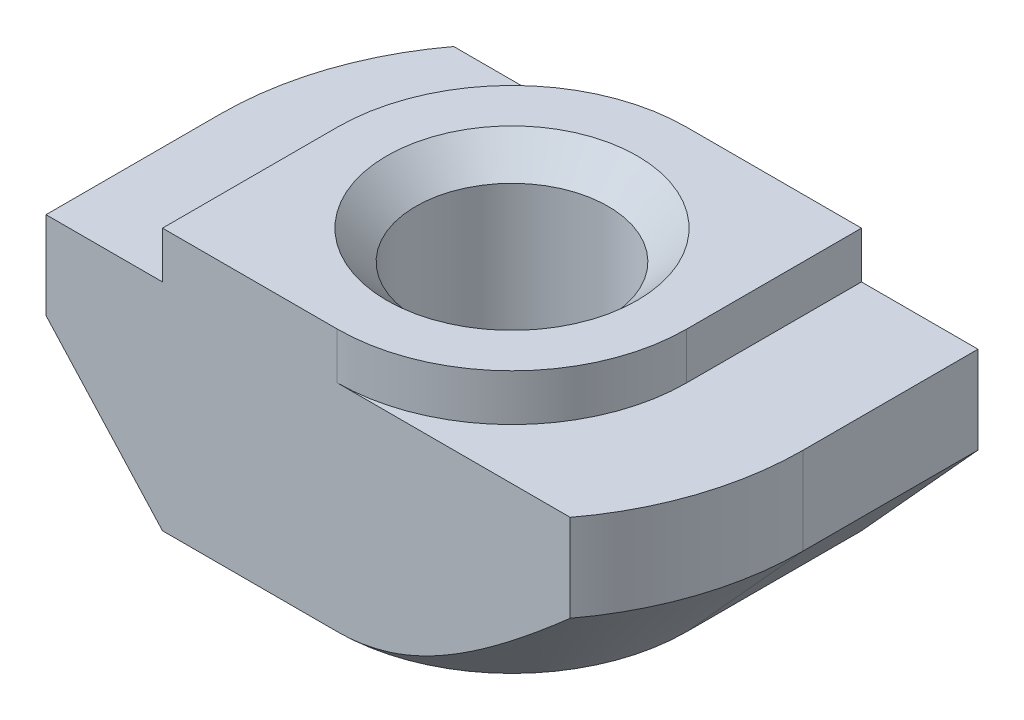
ISO-10303-21;
HEADER;
FILE_DESCRIPTION(('STEP AP214'),'2;1');
FILE_NAME('part.step','',(''),(''),'','','');
FILE_SCHEMA(('AUTOMOTIVE_DESIGN { 1 0 10303 214 1 1 1 1 }'));
ENDSEC;
DATA;
#1=APPLICATION_CONTEXT('core data for automotive mechanical design processes');
#2=APPLICATION_PROTOCOL_DEFINITION('international standard','automotive_design',2000,#1);
#3=PRODUCT_CONTEXT('',#1,'mechanical');
#4=PRODUCT('Part','Part','',(#3));
#5=PRODUCT_RELATED_PRODUCT_CATEGORY('part','',(#4));
#6=PRODUCT_DEFINITION_FORMATION('','',#4);
#7=PRODUCT_DEFINITION_CONTEXT('part definition',#1,'design');
#8=PRODUCT_DEFINITION('design','',#6,#7);
#9=PRODUCT_DEFINITION_SHAPE('','',#8);
#10=(LENGTH_UNIT() NAMED_UNIT(*) SI_UNIT(.MILLI.,.METRE.));
#11=(NAMED_UNIT(*) PLANE_ANGLE_UNIT() SI_UNIT($,.RADIAN.));
#12=(NAMED_UNIT(*) SI_UNIT($,.STERADIAN.) SOLID_ANGLE_UNIT());
#13=UNCERTAINTY_MEASURE_WITH_UNIT(LENGTH_MEASURE(1.E-05),#10,'distance_accuracy_value','');
#14=(GEOMETRIC_REPRESENTATION_CONTEXT(3) GLOBAL_UNCERTAINTY_ASSIGNED_CONTEXT((#13)) GLOBAL_UNIT_ASSIGNED_CONTEXT((#10,
#11,#12)) REPRESENTATION_CONTEXT('',''));
#15=CARTESIAN_POINT('',(0.,0.,0.));
#16=DIRECTION('',(0.,0.,1.));
#17=DIRECTION('',(1.,0.,0.));
#18=AXIS2_PLACEMENT_3D('',#15,#16,#17);
#19=CARTESIAN_POINT('',(-5.,-0.800000000000001,3.));
#20=DIRECTION('',(1.,0.,0.));
#21=DIRECTION('',(0.,0.,-1.));
#22=AXIS2_PLACEMENT_3D('',#19,#20,#21);
#23=PLANE('',#22);
#24=DIRECTION('',(0.,0.,-1.));
#25=VECTOR('',#24,1.);
#26=CARTESIAN_POINT('',(-5.,-2.3,3.));
#27=LINE('',#26,#25);
#28=CARTESIAN_POINT('',(-5.,-2.3,3.));
#29=VERTEX_POINT('',#28);
#30=CARTESIAN_POINT('',(-5.,-2.3,0.));
#31=VERTEX_POINT('',#30);
#32=EDGE_CURVE('E316',#29,#31,#27,.T.);
#33=ORIENTED_EDGE('',*,*,#32,.F.);
#34=DIRECTION('',(0.,-1.,0.));
#35=VECTOR('',#34,1.);
#36=CARTESIAN_POINT('',(-5.,-0.800000000000001,3.));
#37=LINE('',#36,#35);
#38=CARTESIAN_POINT('',(-5.,-0.800000000000001,3.));
#39=VERTEX_POINT('',#38);
#40=EDGE_CURVE('E163',#39,#29,#37,.T.);
#41=ORIENTED_EDGE('',*,*,#40,.F.);
#42=DIRECTION('',(0.,0.,-1.));
#43=VECTOR('',#42,1.);
#44=CARTESIAN_POINT('',(-5.,-0.800000000000001,3.));
#45=LINE('',#44,#43);
#46=CARTESIAN_POINT('',(-5.,-0.800000000000001,0.));
#47=VERTEX_POINT('',#46);
#48=EDGE_CURVE('E45',#39,#47,#45,.T.);
#49=ORIENTED_EDGE('',*,*,#48,.T.);
#50=DIRECTION('',(0.,1.,0.));
#51=VECTOR('',#50,1.);
#52=CARTESIAN_POINT('',(-5.,-4.5,0.));
#53=LINE('',#52,#51);
#54=EDGE_CURVE('E209',#31,#47,#53,.T.);
#55=ORIENTED_EDGE('',*,*,#54,.F.);
#56=EDGE_LOOP('',(#33,#41,#49,#55));
#57=FACE_BOUND('',#56,.T.);
#58=ADVANCED_FACE('F37',(#57),#23,.F.);
#59=CARTESIAN_POINT('',(-5.,-4.5,3.));
#60=DIRECTION('',(0.,1.,0.));
#61=DIRECTION('',(0.,0.,1.));
#62=AXIS2_PLACEMENT_3D('',#59,#60,#61);
#63=PLANE('',#62);
#64=CARTESIAN_POINT('',(0.,-4.5,0.));
#65=DIRECTION('',(0.,1.,0.));
#66=DIRECTION('',(0.,0.,1.));
#67=AXIS2_PLACEMENT_3D('',#64,#65,#66);
#68=CIRCLE('',#67,2.15);
#69=CARTESIAN_POINT('',(0.,-4.5,2.15));
#70=VERTEX_POINT('',#69);
#71=EDGE_CURVE('E258',#70,#70,#68,.T.);
#72=ORIENTED_EDGE('',*,*,#71,.T.);
#73=EDGE_LOOP('',(#72));
#74=FACE_BOUND('',#73,.T.);
#75=DIRECTION('',(1.,0.,0.));
#76=VECTOR('',#75,1.);
#77=CARTESIAN_POINT('',(-5.,-4.5,3.));
#78=LINE('',#77,#76);
#79=CARTESIAN_POINT('',(-3.,-4.5,3.));
#80=VERTEX_POINT('',#79);
#81=CARTESIAN_POINT('',(0.,-4.5,3.));
#82=VERTEX_POINT('',#81);
#83=EDGE_CURVE('E161',#80,#82,#78,.T.);
#84=ORIENTED_EDGE('',*,*,#83,.F.);
#85=DIRECTION('',(0.,0.,-1.));
#86=VECTOR('',#85,1.);
#87=CARTESIAN_POINT('',(-3.,-4.5,3.));
#88=LINE('',#87,#86);
#89=CARTESIAN_POINT('',(-3.,-4.5,0.));
#90=VERTEX_POINT('',#89);
#91=EDGE_CURVE('E146',#80,#90,#88,.T.);
#92=ORIENTED_EDGE('',*,*,#91,.T.);
#93=CARTESIAN_POINT('',(0.,-4.5,0.));
#94=DIRECTION('',(0.,-1.,0.));
#95=DIRECTION('',(-1.,0.,0.));
#96=AXIS2_PLACEMENT_3D('',#93,#94,#95);
#97=CIRCLE('',#96,2.99999999999998);
#98=CARTESIAN_POINT('',(0.,-4.5,-2.99999999999998));
#99=VERTEX_POINT('',#98);
#100=EDGE_CURVE('E317',#90,#99,#97,.T.);
#101=ORIENTED_EDGE('',*,*,#100,.T.);
#102=DIRECTION('',(1.,0.,0.));
#103=VECTOR('',#102,1.);
#104=CARTESIAN_POINT('',(-5.,-4.5,-3.));
#105=LINE('',#104,#103);
#106=CARTESIAN_POINT('',(3.,-4.5,-3.));
#107=VERTEX_POINT('',#106);
#108=EDGE_CURVE('E181',#99,#107,#105,.T.);
#109=ORIENTED_EDGE('',*,*,#108,.T.);
#110=DIRECTION('',(0.,0.,1.));
#111=VECTOR('',#110,1.);
#112=CARTESIAN_POINT('',(3.,-4.5,-5.));
#113=LINE('',#112,#111);
#114=CARTESIAN_POINT('',(3.,-4.5,0.));
#115=VERTEX_POINT('',#114);
#116=EDGE_CURVE('E52',#107,#115,#113,.T.);
#117=ORIENTED_EDGE('',*,*,#116,.T.);
#118=CARTESIAN_POINT('',(0.,-4.5,0.));
#119=DIRECTION('',(0.,-1.,0.));
#120=DIRECTION('',(1.,0.,0.));
#121=AXIS2_PLACEMENT_3D('',#118,#119,#120);
#122=CIRCLE('',#121,3.);
#123=EDGE_CURVE('E167',#115,#82,#122,.T.);
#124=ORIENTED_EDGE('',*,*,#123,.T.);
#125=EDGE_LOOP('',(#84,#92,#101,#109,#117,#124));
#126=FACE_BOUND('',#125,.T.);
#127=ADVANCED_FACE('F166',(#74,#126),#63,.F.);
#128=CARTESIAN_POINT('',(5.,-0.800000000000001,3.));
#129=DIRECTION('',(-1.,0.,0.));
#130=DIRECTION('',(0.,0.,1.));
#131=AXIS2_PLACEMENT_3D('',#128,#129,#130);
#132=PLANE('',#131);
#133=DIRECTION('',(0.,0.,1.));
#134=VECTOR('',#133,1.);
#135=CARTESIAN_POINT('',(5.,-2.3,-5.));
#136=LINE('',#135,#134);
#137=CARTESIAN_POINT('',(5.,-2.3,-3.));
#138=VERTEX_POINT('',#137);
#139=CARTESIAN_POINT('',(5.,-2.3,0.));
#140=VERTEX_POINT('',#139);
#141=EDGE_CURVE('E304',#138,#140,#136,.T.);
#142=ORIENTED_EDGE('',*,*,#141,.F.);
#143=DIRECTION('',(0.,1.,0.));
#144=VECTOR('',#143,1.);
#145=CARTESIAN_POINT('',(5.,-0.800000000000001,-3.));
#146=LINE('',#145,#144);
#147=CARTESIAN_POINT('',(5.,-0.800000000000001,-3.));
#148=VERTEX_POINT('',#147);
#149=EDGE_CURVE('E185',#138,#148,#146,.T.);
#150=ORIENTED_EDGE('',*,*,#149,.T.);
#151=DIRECTION('',(0.,0.,-1.));
#152=VECTOR('',#151,1.);
#153=CARTESIAN_POINT('',(5.,-0.800000000000001,3.));
#154=LINE('',#153,#152);
#155=CARTESIAN_POINT('',(5.,-0.799999999999999,0.));
#156=VERTEX_POINT('',#155);
#157=EDGE_CURVE('E203',#156,#148,#154,.T.);
#158=ORIENTED_EDGE('',*,*,#157,.F.);
#159=DIRECTION('',(0.,1.,0.));
#160=VECTOR('',#159,1.);
#161=CARTESIAN_POINT('',(5.,-4.5,0.));
#162=LINE('',#161,#160);
#163=EDGE_CURVE('E220',#140,#156,#162,.T.);
#164=ORIENTED_EDGE('',*,*,#163,.F.);
#165=EDGE_LOOP('',(#142,#150,#158,#164));
#166=FACE_BOUND('',#165,.T.);
#167=ADVANCED_FACE('F303',(#166),#132,.F.);
#168=CARTESIAN_POINT('',(0.,0.,3.));
#169=DIRECTION('',(0.,0.,-1.));
#170=DIRECTION('',(-1.,0.,0.));
#171=AXIS2_PLACEMENT_3D('',#168,#169,#170);
#172=PLANE('',#171);
#173=DIRECTION('',(-0.672672793996312,0.739940073395944,0.));
#174=VECTOR('',#173,1.);
#175=CARTESIAN_POINT('',(-3.,-4.5,3.));
#176=LINE('',#175,#174);
#177=EDGE_CURVE('E149',#80,#29,#176,.T.);
#178=ORIENTED_EDGE('',*,*,#177,.F.);
#179=ORIENTED_EDGE('',*,*,#83,.T.);
#180=CARTESIAN_POINT('',(8.56528488420533,2.18301393510955,3.));
#181=CARTESIAN_POINT('',(8.336042392276,1.94506172446586,3.));
#182=CARTESIAN_POINT('',(8.10631311159504,1.70757430920956,3.));
#183=CARTESIAN_POINT('',(7.64551409680837,1.23387312686237,3.));
#184=CARTESIAN_POINT('',(7.41444427373792,0.997659446357017,3.));
#185=CARTESIAN_POINT('',(6.95074727857469,0.527002922284947,3.));
#186=CARTESIAN_POINT('',(6.71812096870712,0.292559230318829,3.));
#187=CARTESIAN_POINT('',(6.25067088889651,-0.174118776187672,3.));
#188=CARTESIAN_POINT('',(6.01584718443249,-0.406353156148946,3.));
#189=CARTESIAN_POINT('',(5.62038955383489,-0.792436278152886,3.));
#190=CARTESIAN_POINT('',(5.4605691961006,-0.947117710041531,3.));
#191=CARTESIAN_POINT('',(5.13924211280618,-1.25471973911822,3.));
#192=CARTESIAN_POINT('',(4.97773540088465,-1.40764035052612,3.));
#193=CARTESIAN_POINT('',(4.65243717389983,-1.71134723849659,3.));
#194=CARTESIAN_POINT('',(4.48864364367823,-1.86213136124613,3.));
#195=CARTESIAN_POINT('',(4.15832129849217,-2.16066244382769,3.));
#196=CARTESIAN_POINT('',(3.99179267344124,-2.30840961294253,3.));
#197=CARTESIAN_POINT('',(3.67502933959276,-2.58253769216048,3.));
#198=CARTESIAN_POINT('',(3.52519519671427,-2.70937994437701,3.));
#199=CARTESIAN_POINT('',(3.22192221001868,-2.95867422998659,3.));
#200=CARTESIAN_POINT('',(3.06848376607595,-3.08112674662078,3.));
#201=CARTESIAN_POINT('',(2.75692799570068,-3.31985912877086,3.));
#202=CARTESIAN_POINT('',(2.59881223241667,-3.43614102099504,3.));
#203=CARTESIAN_POINT('',(2.27641686005113,-3.6597947081815,3.));
#204=CARTESIAN_POINT('',(2.1121408480234,-3.76717158878603,3.));
#205=CARTESIAN_POINT('',(1.85623649412789,-3.92021652847901,3.));
#206=CARTESIAN_POINT('',(1.7675565261946,-3.9707797472168,3.));
#207=CARTESIAN_POINT('',(1.58775783924168,-4.06731951755835,3.));
#208=CARTESIAN_POINT('',(1.49663894517337,-4.11329573881462,3.));
#209=CARTESIAN_POINT('',(1.21939259558399,-4.24256333018006,3.));
#210=CARTESIAN_POINT('',(1.02899510158821,-4.31743209180478,3.));
#211=CARTESIAN_POINT('',(0.755392260011176,-4.39800283607005,3.));
#212=CARTESIAN_POINT('',(0.676405488815064,-4.41825370574629,3.));
#213=CARTESIAN_POINT('',(0.517091283393969,-4.45243980770036,3.));
#214=CARTESIAN_POINT('',(0.436764560189595,-4.46637828552201,3.));
#215=CARTESIAN_POINT('',(0.275359895285572,-4.48729817004741,3.));
#216=CARTESIAN_POINT('',(0.194283722501903,-4.49429308094364,3.));
#217=CARTESIAN_POINT('',(0.0318264670063591,-4.50102204849326,3.));
#218=CARTESIAN_POINT('',(-0.0495546116377827,-4.5007562016696,3.));
#219=CARTESIAN_POINT('',(-0.211948053666092,-4.49297827159353,3.));
#220=CARTESIAN_POINT('',(-0.292960487989283,-4.48546764732863,3.));
#221=CARTESIAN_POINT('',(-0.454044201528726,-4.46357758160782,3.));
#222=CARTESIAN_POINT('',(-0.534115415562824,-4.44919766727235,3.));
#223=CARTESIAN_POINT('',(-0.693058117709121,-4.41417073117944,3.));
#224=CARTESIAN_POINT('',(-0.771926319049785,-4.39350896200337,3.));
#225=CARTESIAN_POINT('',(-0.927999706858947,-4.34671001550421,3.));
#226=CARTESIAN_POINT('',(-1.0052048597811,-4.320572727845,3.));
#227=CARTESIAN_POINT('',(-1.25592725377758,-4.22704979034008,3.));
#228=CARTESIAN_POINT('',(-1.42577516041485,-4.14980515635623,3.));
#229=CARTESIAN_POINT('',(-1.7571229896981,-3.97902915008715,3.));
#230=CARTESIAN_POINT('',(-1.91860569192747,-3.88546578765243,3.));
#231=CARTESIAN_POINT('',(-2.23613244034585,-3.68665550264099,3.));
#232=CARTESIAN_POINT('',(-2.39211515222633,-3.58131183983245,3.));
#233=CARTESIAN_POINT('',(-2.69855763508462,-3.36322232970804,3.));
#234=CARTESIAN_POINT('',(-2.84902171438153,-3.25048245691053,3.));
#235=CARTESIAN_POINT('',(-3.13482661197324,-3.02826682192062,3.));
#236=CARTESIAN_POINT('',(-3.27046224875265,-2.91916755772444,3.));
#237=CARTESIAN_POINT('',(-3.53896291037127,-2.6975660478194,3.));
#238=CARTESIAN_POINT('',(-3.67182732431156,-2.58506306490047,3.));
#239=CARTESIAN_POINT('',(-3.93243210144877,-2.35998699053387,3.));
#240=CARTESIAN_POINT('',(-4.06022090599257,-2.24746976299248,3.));
#241=CARTESIAN_POINT('',(-4.31399463935954,-2.02052874188546,3.));
#242=CARTESIAN_POINT('',(-4.43998034134838,-1.90610581397421,3.));
#243=CARTESIAN_POINT('',(-4.56528488420533,-1.79095602034035,3.));
#244=B_SPLINE_CURVE_WITH_KNOTS('',3,(#180,#181,#182,#183,#184,#185,#186,#187,#188,#189,#190,
#191,#192,#193,#194,#195,#196,#197,#198,#199,#200,#201,#202,#203,#204,#205,#206,#207,#208,#209,
#210,#211,#212,#213,#214,#215,#216,#217,#218,#219,#220,#221,#222,#223,#224,#225,#226,#227,#228,
#229,#230,#231,#232,#233,#234,#235,#236,#237,#238,#239,#240,#241,#242,#243),.UNSPECIFIED.,.F.,
.F.,(4,2,2,2,2,2,2,2,2,2,2,2,2,2,2,2,2,2,2,2,2,2,2,2,2,2,2,2,2,2,2,4),(0.,0.991245743739621,
1.98255804143403,2.9733604179706,3.96413336353297,4.63137143495993,5.29860411419179,
5.96646741219647,6.63428453099802,7.22316869295618,7.81198782766621,8.40061235546637,
8.98889837171226,9.29501429973074,9.60115225778937,10.2120870943495,10.4565075459561,
10.7008021846476,10.9446207706796,11.1884361154411,11.4322023697656,11.6759854072942,
11.9203452331532,12.164709983534,12.7229572376404,13.2823114015797,13.8466531824608,
14.410544581934,14.9326795174098,15.4549283631006,15.9657012579663,16.4762481441375),.UNSPECIFIED.);
#245=CARTESIAN_POINT('',(4.,-2.3,3.));
#246=VERTEX_POINT('',#245);
#247=EDGE_CURVE('E321',#246,#82,#244,.T.);
#248=ORIENTED_EDGE('',*,*,#247,.F.);
#249=DIRECTION('',(0.,1.,0.));
#250=VECTOR('',#249,1.);
#251=CARTESIAN_POINT('',(4.,-4.5,3.));
#252=LINE('',#251,#250);
#253=CARTESIAN_POINT('',(4.,-0.8,3.));
#254=VERTEX_POINT('',#253);
#255=EDGE_CURVE('E223',#246,#254,#252,.T.);
#256=ORIENTED_EDGE('',*,*,#255,.T.);
#257=DIRECTION('',(-1.,0.,0.));
#258=VECTOR('',#257,1.);
#259=CARTESIAN_POINT('',(3.,-0.8,3.));
#260=LINE('',#259,#258);
#261=CARTESIAN_POINT('',(0.,-0.8,3.));
#262=VERTEX_POINT('',#261);
#263=EDGE_CURVE('E168',#254,#262,#260,.T.);
#264=ORIENTED_EDGE('',*,*,#263,.T.);
#265=DIRECTION('',(0.,1.,0.));
#266=VECTOR('',#265,1.);
#267=CARTESIAN_POINT('',(0.,-5.04264068711929,3.));
#268=LINE('',#267,#266);
#269=CARTESIAN_POINT('',(0.,0.,3.));
#270=VERTEX_POINT('',#269);
#271=EDGE_CURVE('E246',#262,#270,#268,.T.);
#272=ORIENTED_EDGE('',*,*,#271,.T.);
#273=DIRECTION('',(-1.,0.,0.));
#274=VECTOR('',#273,1.);
#275=CARTESIAN_POINT('',(3.,0.,3.));
#276=LINE('',#275,#274);
#277=CARTESIAN_POINT('',(-3.,0.,3.));
#278=VERTEX_POINT('',#277);
#279=EDGE_CURVE('E170',#270,#278,#276,.T.);
#280=ORIENTED_EDGE('',*,*,#279,.T.);
#281=DIRECTION('',(0.,-1.,0.));
#282=VECTOR('',#281,1.);
#283=CARTESIAN_POINT('',(-3.,0.,3.));
#284=LINE('',#283,#282);
#285=CARTESIAN_POINT('',(-3.,-0.8,3.));
#286=VERTEX_POINT('',#285);
#287=EDGE_CURVE('E196',#278,#286,#284,.T.);
#288=ORIENTED_EDGE('',*,*,#287,.T.);
#289=DIRECTION('',(-1.,0.,0.));
#290=VECTOR('',#289,1.);
#291=CARTESIAN_POINT('',(-3.,-0.8,3.));
#292=LINE('',#291,#290);
#293=EDGE_CURVE('E172',#286,#39,#292,.T.);
#294=ORIENTED_EDGE('',*,*,#293,.T.);
#295=ORIENTED_EDGE('',*,*,#40,.T.);
#296=EDGE_LOOP('',(#178,#179,#248,#256,#264,#272,#280,#288,#294,#295));
#297=FACE_BOUND('',#296,.T.);
#298=ADVANCED_FACE('F159',(#297),#172,.F.);
#299=CARTESIAN_POINT('',(0.,0.,-3.));
#300=DIRECTION('',(0.,0.,-1.));
#301=DIRECTION('',(-1.,0.,0.));
#302=AXIS2_PLACEMENT_3D('',#299,#300,#301);
#303=PLANE('',#302);
#304=ORIENTED_EDGE('',*,*,#108,.F.);
#305=CARTESIAN_POINT('',(4.56528488420533,-1.79095602034032,-3.));
#306=CARTESIAN_POINT('',(4.42839885729641,-1.91673342260761,-3.));
#307=CARTESIAN_POINT('',(4.29070825629604,-2.04165708123198,-3.));
#308=CARTESIAN_POINT('',(4.01311022137334,-2.2891985262993,-3.));
#309=CARTESIAN_POINT('',(3.87320138847394,-2.41181474149276,-3.));
#310=CARTESIAN_POINT('',(3.5856246865415,-2.65835932361061,-3.));
#311=CARTESIAN_POINT('',(3.43785929429621,-2.78217447169403,-3.));
#312=CARTESIAN_POINT('',(3.13870555712778,-3.02527946804254,-3.));
#313=CARTESIAN_POINT('',(2.98731837973417,-3.14457074341603,-3.));
#314=CARTESIAN_POINT('',(2.67932755554925,-3.37720476464405,-3.));
#315=CARTESIAN_POINT('',(2.52271020820245,-3.49052949185593,-3.));
#316=CARTESIAN_POINT('',(2.20296452147528,-3.7081776430567,-3.));
#317=CARTESIAN_POINT('',(2.03982933047826,-3.81249120982559,-3.));
#318=CARTESIAN_POINT('',(1.79019758577874,-3.9578704108561,-3.));
#319=CARTESIAN_POINT('',(1.7067775126684,-4.00418975204737,-3.));
#320=CARTESIAN_POINT('',(1.53775147544231,-4.09263547313203,-3.));
#321=CARTESIAN_POINT('',(1.45214519070862,-4.13476123352878,-3.));
#322=CARTESIAN_POINT('',(1.19210931334085,-4.25323556698663,-3.));
#323=CARTESIAN_POINT('',(1.01395131317746,-4.32199210170041,-3.));
#324=CARTESIAN_POINT('',(0.745346751873809,-4.40089868793778,-3.));
#325=CARTESIAN_POINT('',(0.658318453040623,-4.42281603815454,-3.));
#326=CARTESIAN_POINT('',(0.482642298238637,-4.45891278284897,-3.));
#327=CARTESIAN_POINT('',(0.393994581761194,-4.47309284057409,-3.));
#328=CARTESIAN_POINT('',(0.216037909471066,-4.49288207496988,-3.));
#329=CARTESIAN_POINT('',(0.126732197427173,-4.49852003254059,-3.));
#330=CARTESIAN_POINT('',(-0.0520026715756645,-4.50096807462647,-3.));
#331=CARTESIAN_POINT('',(-0.141431827603297,-4.49777822538231,-3.));
#332=CARTESIAN_POINT('',(-0.319250763933687,-4.48279609283911,-3.));
#333=CARTESIAN_POINT('',(-0.407643026018313,-4.47103273201148,-3.));
#334=CARTESIAN_POINT('',(-0.583018344588809,-4.43960959822698,-3.));
#335=CARTESIAN_POINT('',(-0.670000952598425,-4.41994736165903,-3.));
#336=CARTESIAN_POINT('',(-0.842486782458988,-4.37358373680897,-3.));
#337=CARTESIAN_POINT('',(-0.9279810314998,-4.34684940618518,-3.));
#338=CARTESIAN_POINT('',(-1.0968573659184,-4.28745146556704,-3.));
#339=CARTESIAN_POINT('',(-1.18023946905554,-4.25478790544571,-3.));
#340=CARTESIAN_POINT('',(-1.36570253725023,-4.17565465593902,-3.));
#341=CARTESIAN_POINT('',(-1.46718157138529,-4.12778226156665,-3.));
#342=CARTESIAN_POINT('',(-1.66707298699795,-4.02597724576113,-3.));
#343=CARTESIAN_POINT('',(-1.76548385637139,-3.97204169465492,-3.));
#344=CARTESIAN_POINT('',(-1.95973278437517,-3.85933814531602,-3.));
#345=CARTESIAN_POINT('',(-2.05556549824463,-3.80056100153299,-3.));
#346=CARTESIAN_POINT('',(-2.24481227463867,-3.6792892907557,-3.));
#347=CARTESIAN_POINT('',(-2.33822672015715,-3.61679531764913,-3.));
#348=CARTESIAN_POINT('',(-2.52405927711159,-3.48811153305375,-3.));
#349=CARTESIAN_POINT('',(-2.61645357258282,-3.42188748133433,-3.));
#350=CARTESIAN_POINT('',(-2.79944858607247,-3.28700935921293,-3.));
#351=CARTESIAN_POINT('',(-2.89004925164131,-3.21835521791309,-3.));
#352=CARTESIAN_POINT('',(-3.06961311011181,-3.07915767893173,-3.));
#353=CARTESIAN_POINT('',(-3.15857809973083,-3.00861659270619,-3.));
#354=CARTESIAN_POINT('',(-3.33519795578114,-2.86591970498384,-3.));
#355=CARTESIAN_POINT('',(-3.4228528435281,-2.79376392980623,-3.));
#356=CARTESIAN_POINT('',(-3.62621162727783,-2.62372045812024,-3.));
#357=CARTESIAN_POINT('',(-3.74147696764729,-2.52530870473998,-3.));
#358=CARTESIAN_POINT('',(-3.97036354639596,-2.32658886836678,-3.));
#359=CARTESIAN_POINT('',(-4.08398472073968,-2.2262807118635,-3.));
#360=CARTESIAN_POINT('',(-4.42284189926169,-1.92305836675397,-3.));
#361=CARTESIAN_POINT('',(-4.64604269620312,-1.71787076794243,-3.));
#362=CARTESIAN_POINT('',(-5.08885043587136,-1.30320023106152,-3.));
#363=CARTESIAN_POINT('',(-5.30845317819351,-1.09371283796563,-3.));
#364=CARTESIAN_POINT('',(-5.74484899551352,-0.671825061357189,-3.));
#365=CARTESIAN_POINT('',(-5.96164199489613,-0.459424599763989,-3.));
#366=CARTESIAN_POINT('',(-6.37936652531521,-0.0460880905598762,-3.));
#367=CARTESIAN_POINT('',(-6.58042866504368,0.154716268202102,-3.));
#368=CARTESIAN_POINT('',(-6.98110372806068,0.557774180103405,-3.));
#369=CARTESIAN_POINT('',(-7.18071661572182,0.760027768628347,-3.));
#370=CARTESIAN_POINT('',(-7.5783559544936,1.16522743736274,-3.));
#371=CARTESIAN_POINT('',(-7.77638490659006,1.36817106601214,-3.));
#372=CARTESIAN_POINT('',(-8.17149294521518,1.77496414757543,-3.));
#373=CARTESIAN_POINT('',(-8.36857207240979,1.97881356097766,-3.));
#374=CARTESIAN_POINT('',(-8.56528488420533,2.18301393510958,-3.));
#375=B_SPLINE_CURVE_WITH_KNOTS('',3,(#305,#306,#307,#308,#309,#310,#311,#312,#313,#314,#315,
#316,#317,#318,#319,#320,#321,#322,#323,#324,#325,#326,#327,#328,#329,#330,#331,#332,#333,#334,
#335,#336,#337,#338,#339,#340,#341,#342,#343,#344,#345,#346,#347,#348,#349,#350,#351,#352,#353,
#354,#355,#356,#357,#358,#359,#360,#361,#362,#363,#364,#365,#366,#367,#368,#369,#370,#371,#372,
#373,#374),.UNSPECIFIED.,.F.,.F.,(4,2,2,2,2,2,2,2,2,2,2,2,2,2,2,2,2,2,2,2,2,2,2,2,2,2,2,2,2,2,2,
2,2,2,4),(0.,0.557709889033308,1.11578672818032,1.69406871798971,2.27216673821034,
2.85192074217125,3.43230110810091,3.71843822555145,4.00461755007192,4.57518829810499,
4.84414410060724,5.11307684436059,5.38110144203277,5.64912402855096,5.91624660987452,
6.18345256986256,6.45192580847491,6.72039678896069,7.05673990097462,7.39324623580336,
7.73040347109618,8.0675069782348,8.40848761114185,8.74947820037108,9.0900686587882,
9.43065356966887,9.88531114864963,10.3399863878215,11.2494503335336,12.1599095877827,
13.0703932934704,13.922872369386,14.775372331565,15.6260242906098,16.4766395002808),.UNSPECIFIED.);
#376=CARTESIAN_POINT('',(-4.,-2.29999999999998,-3.));
#377=VERTEX_POINT('',#376);
#378=EDGE_CURVE('E227',#99,#377,#375,.T.);
#379=ORIENTED_EDGE('',*,*,#378,.T.);
#380=DIRECTION('',(0.,1.,0.));
#381=VECTOR('',#380,1.);
#382=CARTESIAN_POINT('',(-4.,-4.5,-3.));
#383=LINE('',#382,#381);
#384=CARTESIAN_POINT('',(-4.,-0.8,-3.));
#385=VERTEX_POINT('',#384);
#386=EDGE_CURVE('E219',#377,#385,#383,.T.);
#387=ORIENTED_EDGE('',*,*,#386,.T.);
#388=DIRECTION('',(-1.,0.,0.));
#389=VECTOR('',#388,1.);
#390=CARTESIAN_POINT('',(-3.,-0.8,-3.));
#391=LINE('',#390,#389);
#392=CARTESIAN_POINT('',(0.,-0.8,-3.));
#393=VERTEX_POINT('',#392);
#394=EDGE_CURVE('E178',#393,#385,#391,.T.);
#395=ORIENTED_EDGE('',*,*,#394,.F.);
#396=DIRECTION('',(0.,1.,0.));
#397=VECTOR('',#396,1.);
#398=CARTESIAN_POINT('',(0.,-5.04264068711929,-3.));
#399=LINE('',#398,#397);
#400=CARTESIAN_POINT('',(0.,0.,-3.));
#401=VERTEX_POINT('',#400);
#402=EDGE_CURVE('E255',#393,#401,#399,.T.);
#403=ORIENTED_EDGE('',*,*,#402,.T.);
#404=DIRECTION('',(-1.,0.,0.));
#405=VECTOR('',#404,1.);
#406=CARTESIAN_POINT('',(3.,0.,-3.));
#407=LINE('',#406,#405);
#408=CARTESIAN_POINT('',(3.,0.,-3.));
#409=VERTEX_POINT('',#408);
#410=EDGE_CURVE('E193',#409,#401,#407,.T.);
#411=ORIENTED_EDGE('',*,*,#410,.F.);
#412=DIRECTION('',(0.,1.,0.));
#413=VECTOR('',#412,1.);
#414=CARTESIAN_POINT('',(3.,0.,-3.));
#415=LINE('',#414,#413);
#416=CARTESIAN_POINT('',(3.,-0.8,-3.));
#417=VERTEX_POINT('',#416);
#418=EDGE_CURVE('E190',#417,#409,#415,.T.);
#419=ORIENTED_EDGE('',*,*,#418,.F.);
#420=DIRECTION('',(-1.,0.,0.));
#421=VECTOR('',#420,1.);
#422=CARTESIAN_POINT('',(3.,-0.8,-3.));
#423=LINE('',#422,#421);
#424=EDGE_CURVE('E187',#148,#417,#423,.T.);
#425=ORIENTED_EDGE('',*,*,#424,.F.);
#426=ORIENTED_EDGE('',*,*,#149,.F.);
#427=DIRECTION('',(-0.672672793996313,-0.739940073395944,0.));
#428=VECTOR('',#427,1.);
#429=CARTESIAN_POINT('',(3.88235294117647,-3.52941176470588,-3.));
#430=LINE('',#429,#428);
#431=EDGE_CURVE('E313',#138,#107,#430,.T.);
#432=ORIENTED_EDGE('',*,*,#431,.T.);
#433=EDGE_LOOP('',(#304,#379,#387,#395,#403,#411,#419,#425,#426,#432));
#434=FACE_BOUND('',#433,.T.);
#435=ADVANCED_FACE('F283',(#434),#303,.T.);
#436=CARTESIAN_POINT('',(0.,-4.5,0.));
#437=DIRECTION('',(0.,1.,0.));
#438=DIRECTION('',(-1.,0.,0.));
#439=AXIS2_PLACEMENT_3D('',#436,#437,#438);
#440=CYLINDRICAL_SURFACE('',#439,5.);
#441=CARTESIAN_POINT('',(0.,-2.3,0.));
#442=DIRECTION('',(0.,-1.,0.));
#443=DIRECTION('',(-1.,0.,0.));
#444=AXIS2_PLACEMENT_3D('',#441,#442,#443);
#445=CIRCLE('',#444,4.99999999999998);
#446=EDGE_CURVE('E60',#31,#377,#445,.T.);
#447=ORIENTED_EDGE('',*,*,#446,.F.);
#448=ORIENTED_EDGE('',*,*,#54,.T.);
#449=CARTESIAN_POINT('',(0.,-0.8,0.));
#450=DIRECTION('',(0.,-1.,0.));
#451=DIRECTION('',(-1.,0.,0.));
#452=AXIS2_PLACEMENT_3D('',#449,#450,#451);
#453=CIRCLE('',#452,5.);
#454=EDGE_CURVE('E215',#47,#385,#453,.T.);
#455=ORIENTED_EDGE('',*,*,#454,.T.);
#456=ORIENTED_EDGE('',*,*,#386,.F.);
#457=EDGE_LOOP('',(#447,#448,#455,#456));
#458=FACE_BOUND('',#457,.T.);
#459=ADVANCED_FACE('F344',(#458),#440,.T.);
#460=CARTESIAN_POINT('',(0.,-4.5,0.));
#461=DIRECTION('',(0.,1.,0.));
#462=DIRECTION('',(-1.,0.,0.));
#463=AXIS2_PLACEMENT_3D('',#460,#461,#462);
#464=CYLINDRICAL_SURFACE('',#463,5.);
#465=CARTESIAN_POINT('',(0.,-2.3,0.));
#466=DIRECTION('',(0.,-1.,0.));
#467=DIRECTION('',(1.,0.,0.));
#468=AXIS2_PLACEMENT_3D('',#465,#466,#467);
#469=CIRCLE('',#468,5.);
#470=EDGE_CURVE('E309',#140,#246,#469,.T.);
#471=ORIENTED_EDGE('',*,*,#470,.F.);
#472=ORIENTED_EDGE('',*,*,#163,.T.);
#473=CARTESIAN_POINT('',(0.,-0.8,0.));
#474=DIRECTION('',(0.,-1.,0.));
#475=DIRECTION('',(1.,0.,0.));
#476=AXIS2_PLACEMENT_3D('',#473,#474,#475);
#477=CIRCLE('',#476,5.);
#478=EDGE_CURVE('E237',#156,#254,#477,.T.);
#479=ORIENTED_EDGE('',*,*,#478,.T.);
#480=ORIENTED_EDGE('',*,*,#255,.F.);
#481=EDGE_LOOP('',(#471,#472,#479,#480));
#482=FACE_BOUND('',#481,.T.);
#483=ADVANCED_FACE('F347',(#482),#464,.T.);
#484=CARTESIAN_POINT('',(-3.,0.,3.));
#485=DIRECTION('',(1.,0.,0.));
#486=DIRECTION('',(0.,0.,-1.));
#487=AXIS2_PLACEMENT_3D('',#484,#485,#486);
#488=PLANE('',#487);
#489=DIRECTION('',(0.,0.,-1.));
#490=VECTOR('',#489,1.);
#491=CARTESIAN_POINT('',(-3.,0.,3.));
#492=LINE('',#491,#490);
#493=CARTESIAN_POINT('',(-3.,0.,0.));
#494=VERTEX_POINT('',#493);
#495=EDGE_CURVE('E177',#278,#494,#492,.T.);
#496=ORIENTED_EDGE('',*,*,#495,.T.);
#497=DIRECTION('',(0.,1.,0.));
#498=VECTOR('',#497,1.);
#499=CARTESIAN_POINT('',(-3.,-5.04264068711929,0.));
#500=LINE('',#499,#498);
#501=CARTESIAN_POINT('',(-3.,-0.8,0.));
#502=VERTEX_POINT('',#501);
#503=EDGE_CURVE('E252',#502,#494,#500,.T.);
#504=ORIENTED_EDGE('',*,*,#503,.F.);
#505=DIRECTION('',(0.,0.,-1.));
#506=VECTOR('',#505,1.);
#507=CARTESIAN_POINT('',(-3.,-0.8,3.));
#508=LINE('',#507,#506);
#509=EDGE_CURVE('E11',#286,#502,#508,.T.);
#510=ORIENTED_EDGE('',*,*,#509,.F.);
#511=ORIENTED_EDGE('',*,*,#287,.F.);
#512=EDGE_LOOP('',(#496,#504,#510,#511));
#513=FACE_BOUND('',#512,.T.);
#514=ADVANCED_FACE('F39',(#513),#488,.F.);
#515=CARTESIAN_POINT('',(-3.,-0.8,3.));
#516=DIRECTION('',(0.,-1.,0.));
#517=DIRECTION('',(1.,0.,0.));
#518=AXIS2_PLACEMENT_3D('',#515,#516,#517);
#519=PLANE('',#518);
#520=ORIENTED_EDGE('',*,*,#394,.T.);
#521=ORIENTED_EDGE('',*,*,#454,.F.);
#522=ORIENTED_EDGE('',*,*,#48,.F.);
#523=ORIENTED_EDGE('',*,*,#293,.F.);
#524=ORIENTED_EDGE('',*,*,#509,.T.);
#525=CARTESIAN_POINT('',(0.,-0.8,0.));
#526=DIRECTION('',(0.,-1.,0.));
#527=DIRECTION('',(1.,0.,0.));
#528=AXIS2_PLACEMENT_3D('',#525,#526,#527);
#529=CIRCLE('',#528,3.);
#530=EDGE_CURVE('E253',#502,#393,#529,.T.);
#531=ORIENTED_EDGE('',*,*,#530,.T.);
#532=EDGE_LOOP('',(#520,#521,#522,#523,#524,#531));
#533=FACE_BOUND('',#532,.T.);
#534=ADVANCED_FACE('F212',(#533),#519,.F.);
#535=CARTESIAN_POINT('',(3.,-0.8,3.));
#536=DIRECTION('',(0.,-1.,0.));
#537=DIRECTION('',(1.,0.,0.));
#538=AXIS2_PLACEMENT_3D('',#535,#536,#537);
#539=PLANE('',#538);
#540=ORIENTED_EDGE('',*,*,#263,.F.);
#541=ORIENTED_EDGE('',*,*,#478,.F.);
#542=ORIENTED_EDGE('',*,*,#157,.T.);
#543=ORIENTED_EDGE('',*,*,#424,.T.);
#544=DIRECTION('',(0.,0.,-1.));
#545=VECTOR('',#544,1.);
#546=CARTESIAN_POINT('',(3.,-0.8,3.));
#547=LINE('',#546,#545);
#548=CARTESIAN_POINT('',(3.,-0.799999999999999,0.));
#549=VERTEX_POINT('',#548);
#550=EDGE_CURVE('E201',#549,#417,#547,.T.);
#551=ORIENTED_EDGE('',*,*,#550,.F.);
#552=CARTESIAN_POINT('',(0.,-0.8,0.));
#553=DIRECTION('',(0.,-1.,0.));
#554=DIRECTION('',(1.,0.,0.));
#555=AXIS2_PLACEMENT_3D('',#552,#553,#554);
#556=CIRCLE('',#555,3.);
#557=EDGE_CURVE('E243',#549,#262,#556,.T.);
#558=ORIENTED_EDGE('',*,*,#557,.T.);
#559=EDGE_LOOP('',(#540,#541,#542,#543,#551,#558));
#560=FACE_BOUND('',#559,.T.);
#561=ADVANCED_FACE('F297',(#560),#539,.F.);
#562=CARTESIAN_POINT('',(3.,0.,3.));
#563=DIRECTION('',(-1.,0.,0.));
#564=DIRECTION('',(0.,0.,1.));
#565=AXIS2_PLACEMENT_3D('',#562,#563,#564);
#566=PLANE('',#565);
#567=DIRECTION('',(0.,0.,-1.));
#568=VECTOR('',#567,1.);
#569=CARTESIAN_POINT('',(3.,0.,3.));
#570=LINE('',#569,#568);
#571=CARTESIAN_POINT('',(3.,0.,0.));
#572=VERTEX_POINT('',#571);
#573=EDGE_CURVE('E199',#572,#409,#570,.T.);
#574=ORIENTED_EDGE('',*,*,#573,.F.);
#575=DIRECTION('',(0.,1.,0.));
#576=VECTOR('',#575,1.);
#577=CARTESIAN_POINT('',(3.,-5.04264068711929,0.));
#578=LINE('',#577,#576);
#579=EDGE_CURVE('E242',#549,#572,#578,.T.);
#580=ORIENTED_EDGE('',*,*,#579,.F.);
#581=ORIENTED_EDGE('',*,*,#550,.T.);
#582=ORIENTED_EDGE('',*,*,#418,.T.);
#583=EDGE_LOOP('',(#574,#580,#581,#582));
#584=FACE_BOUND('',#583,.T.);
#585=ADVANCED_FACE('F291',(#584),#566,.F.);
#586=CARTESIAN_POINT('',(3.,0.,3.));
#587=DIRECTION('',(0.,-1.,0.));
#588=DIRECTION('',(0.,0.,-1.));
#589=AXIS2_PLACEMENT_3D('',#586,#587,#588);
#590=PLANE('',#589);
#591=CARTESIAN_POINT('',(0.,0.,0.));
#592=DIRECTION('',(0.,1.,0.));
#593=DIRECTION('',(0.,0.,1.));
#594=AXIS2_PLACEMENT_3D('',#591,#592,#593);
#595=CIRCLE('',#594,2.15);
#596=CARTESIAN_POINT('',(0.,0.,2.15));
#597=VERTEX_POINT('',#596);
#598=EDGE_CURVE('E262',#597,#597,#595,.T.);
#599=ORIENTED_EDGE('',*,*,#598,.F.);
#600=EDGE_LOOP('',(#599));
#601=FACE_BOUND('',#600,.T.);
#602=ORIENTED_EDGE('',*,*,#279,.F.);
#603=CARTESIAN_POINT('',(0.,0.,0.));
#604=DIRECTION('',(0.,-1.,0.));
#605=DIRECTION('',(0.,0.,-1.));
#606=AXIS2_PLACEMENT_3D('',#603,#604,#605);
#607=CIRCLE('',#606,3.);
#608=EDGE_CURVE('E235',#572,#270,#607,.T.);
#609=ORIENTED_EDGE('',*,*,#608,.F.);
#610=ORIENTED_EDGE('',*,*,#573,.T.);
#611=ORIENTED_EDGE('',*,*,#410,.T.);
#612=CARTESIAN_POINT('',(0.,0.,0.));
#613=DIRECTION('',(0.,-1.,0.));
#614=DIRECTION('',(0.,0.,-1.));
#615=AXIS2_PLACEMENT_3D('',#612,#613,#614);
#616=CIRCLE('',#615,3.);
#617=EDGE_CURVE('E250',#494,#401,#616,.T.);
#618=ORIENTED_EDGE('',*,*,#617,.F.);
#619=ORIENTED_EDGE('',*,*,#495,.F.);
#620=EDGE_LOOP('',(#602,#609,#610,#611,#618,#619));
#621=FACE_BOUND('',#620,.T.);
#622=ADVANCED_FACE('F286',(#601,#621),#590,.F.);
#623=CARTESIAN_POINT('',(0.,-4.,0.));
#624=DIRECTION('',(0.,-1.,0.));
#625=DIRECTION('',(0.,0.,-1.));
#626=AXIS2_PLACEMENT_3D('',#623,#624,#625);
#627=CONICAL_SURFACE('',#626,1.65,0.785398163397447);
#628=ORIENTED_EDGE('',*,*,#71,.F.);
#629=EDGE_LOOP('',(#628));
#630=FACE_BOUND('',#629,.T.);
#631=CARTESIAN_POINT('',(0.,-4.,0.));
#632=DIRECTION('',(0.,1.,0.));
#633=DIRECTION('',(0.,0.,1.));
#634=AXIS2_PLACEMENT_3D('',#631,#632,#633);
#635=CIRCLE('',#634,1.65);
#636=CARTESIAN_POINT('',(0.,-4.,1.65));
#637=VERTEX_POINT('',#636);
#638=EDGE_CURVE('E182',#637,#637,#635,.T.);
#639=ORIENTED_EDGE('',*,*,#638,.T.);
#640=EDGE_LOOP('',(#639));
#641=FACE_BOUND('',#640,.T.);
#642=ADVANCED_FACE('F362',(#630,#641),#627,.F.);
#643=CARTESIAN_POINT('',(0.,0.,0.));
#644=DIRECTION('',(0.,1.,0.));
#645=DIRECTION('',(0.,0.,1.));
#646=AXIS2_PLACEMENT_3D('',#643,#644,#645);
#647=CYLINDRICAL_SURFACE('',#646,1.65);
#648=ORIENTED_EDGE('',*,*,#638,.F.);
#649=EDGE_LOOP('',(#648));
#650=FACE_BOUND('',#649,.T.);
#651=CARTESIAN_POINT('',(0.,-0.499999999999999,0.));
#652=DIRECTION('',(0.,1.,0.));
#653=DIRECTION('',(0.,0.,1.));
#654=AXIS2_PLACEMENT_3D('',#651,#652,#653);
#655=CIRCLE('',#654,1.65);
#656=CARTESIAN_POINT('',(0.,-0.499999999999999,1.65));
#657=VERTEX_POINT('',#656);
#658=EDGE_CURVE('E265',#657,#657,#655,.T.);
#659=ORIENTED_EDGE('',*,*,#658,.T.);
#660=EDGE_LOOP('',(#659));
#661=FACE_BOUND('',#660,.T.);
#662=ADVANCED_FACE('F359',(#650,#661),#647,.F.);
#663=CARTESIAN_POINT('',(0.,0.,0.));
#664=DIRECTION('',(0.,1.,0.));
#665=DIRECTION('',(0.,0.,1.));
#666=AXIS2_PLACEMENT_3D('',#663,#664,#665);
#667=CONICAL_SURFACE('',#666,2.15,0.78539816339745);
#668=ORIENTED_EDGE('',*,*,#658,.F.);
#669=EDGE_LOOP('',(#668));
#670=FACE_BOUND('',#669,.T.);
#671=ORIENTED_EDGE('',*,*,#598,.T.);
#672=EDGE_LOOP('',(#671));
#673=FACE_BOUND('',#672,.T.);
#674=ADVANCED_FACE('F356',(#670,#673),#667,.F.);
#675=CARTESIAN_POINT('',(0.,-5.04264068711929,0.));
#676=DIRECTION('',(0.,1.,0.));
#677=DIRECTION('',(0.,0.,1.));
#678=AXIS2_PLACEMENT_3D('',#675,#676,#677);
#679=CYLINDRICAL_SURFACE('',#678,3.);
#680=ORIENTED_EDGE('',*,*,#503,.T.);
#681=ORIENTED_EDGE('',*,*,#617,.T.);
#682=ORIENTED_EDGE('',*,*,#402,.F.);
#683=ORIENTED_EDGE('',*,*,#530,.F.);
#684=EDGE_LOOP('',(#680,#681,#682,#683));
#685=FACE_BOUND('',#684,.T.);
#686=ADVANCED_FACE('F278',(#685),#679,.T.);
#687=CARTESIAN_POINT('',(0.,-5.04264068711929,0.));
#688=DIRECTION('',(0.,1.,0.));
#689=DIRECTION('',(0.,0.,1.));
#690=AXIS2_PLACEMENT_3D('',#687,#688,#689);
#691=CYLINDRICAL_SURFACE('',#690,3.);
#692=ORIENTED_EDGE('',*,*,#579,.T.);
#693=ORIENTED_EDGE('',*,*,#608,.T.);
#694=ORIENTED_EDGE('',*,*,#271,.F.);
#695=ORIENTED_EDGE('',*,*,#557,.F.);
#696=EDGE_LOOP('',(#692,#693,#694,#695));
#697=FACE_BOUND('',#696,.T.);
#698=ADVANCED_FACE('F339',(#697),#691,.T.);
#699=CARTESIAN_POINT('',(3.,-4.5,-5.));
#700=DIRECTION('',(0.739940073395944,-0.672672793996312,0.));
#701=DIRECTION('',(0.672672793996313,0.739940073395944,0.));
#702=AXIS2_PLACEMENT_3D('',#699,#700,#701);
#703=PLANE('',#702);
#704=ORIENTED_EDGE('',*,*,#141,.T.);
#705=DIRECTION('',(0.672672793996312,0.739940073395944,0.));
#706=VECTOR('',#705,1.);
#707=CARTESIAN_POINT('',(3.,-4.5,0.));
#708=LINE('',#707,#706);
#709=EDGE_CURVE('E306',#115,#140,#708,.T.);
#710=ORIENTED_EDGE('',*,*,#709,.F.);
#711=ORIENTED_EDGE('',*,*,#116,.F.);
#712=ORIENTED_EDGE('',*,*,#431,.F.);
#713=EDGE_LOOP('',(#704,#710,#711,#712));
#714=FACE_BOUND('',#713,.T.);
#715=ADVANCED_FACE('F334',(#714),#703,.T.);
#716=CARTESIAN_POINT('',(0.,-4.5,0.));
#717=DIRECTION('',(0.,1.,0.));
#718=DIRECTION('',(0.,0.,1.));
#719=AXIS2_PLACEMENT_3D('',#716,#717,#718);
#720=CONICAL_SURFACE('',#719,3.,0.737815060120465);
#721=ORIENTED_EDGE('',*,*,#247,.T.);
#722=ORIENTED_EDGE('',*,*,#123,.F.);
#723=ORIENTED_EDGE('',*,*,#709,.T.);
#724=ORIENTED_EDGE('',*,*,#470,.T.);
#725=EDGE_LOOP('',(#721,#722,#723,#724));
#726=FACE_BOUND('',#725,.T.);
#727=ADVANCED_FACE('F330',(#726),#720,.T.);
#728=CARTESIAN_POINT('',(-3.,-4.5,3.));
#729=DIRECTION('',(-0.739940073395944,-0.672672793996312,0.));
#730=DIRECTION('',(0.672672793996313,-0.739940073395944,0.));
#731=AXIS2_PLACEMENT_3D('',#728,#729,#730);
#732=PLANE('',#731);
#733=ORIENTED_EDGE('',*,*,#32,.T.);
#734=DIRECTION('',(-0.672672793996312,0.739940073395944,0.));
#735=VECTOR('',#734,1.);
#736=CARTESIAN_POINT('',(-3.,-4.5,0.));
#737=LINE('',#736,#735);
#738=EDGE_CURVE('E151',#90,#31,#737,.T.);
#739=ORIENTED_EDGE('',*,*,#738,.F.);
#740=ORIENTED_EDGE('',*,*,#91,.F.);
#741=ORIENTED_EDGE('',*,*,#177,.T.);
#742=EDGE_LOOP('',(#733,#739,#740,#741));
#743=FACE_BOUND('',#742,.T.);
#744=ADVANCED_FACE('F148',(#743),#732,.T.);
#745=CARTESIAN_POINT('',(0.,-4.5,0.));
#746=DIRECTION('',(0.,1.,0.));
#747=DIRECTION('',(0.,0.,1.));
#748=AXIS2_PLACEMENT_3D('',#745,#746,#747);
#749=CONICAL_SURFACE('',#748,2.99999999999998,0.737815060120465);
#750=ORIENTED_EDGE('',*,*,#100,.F.);
#751=ORIENTED_EDGE('',*,*,#738,.T.);
#752=ORIENTED_EDGE('',*,*,#446,.T.);
#753=ORIENTED_EDGE('',*,*,#378,.F.);
#754=EDGE_LOOP('',(#750,#751,#752,#753));
#755=FACE_BOUND('',#754,.T.);
#756=ADVANCED_FACE('F336',(#755),#749,.T.);
#757=CLOSED_SHELL('',(#58,#127,#167,#298,#435,#459,#483,#514,#534,#561,#585,#622,#642,#662,#674,
#686,#698,#715,#727,#744,#756));
#758=MANIFOLD_SOLID_BREP('B2',#757);
#759=ADVANCED_BREP_SHAPE_REPRESENTATION('',(#18,#758),#14);
#760=SHAPE_DEFINITION_REPRESENTATION(#9,#759);
ENDSEC;
END-ISO-10303-21;
